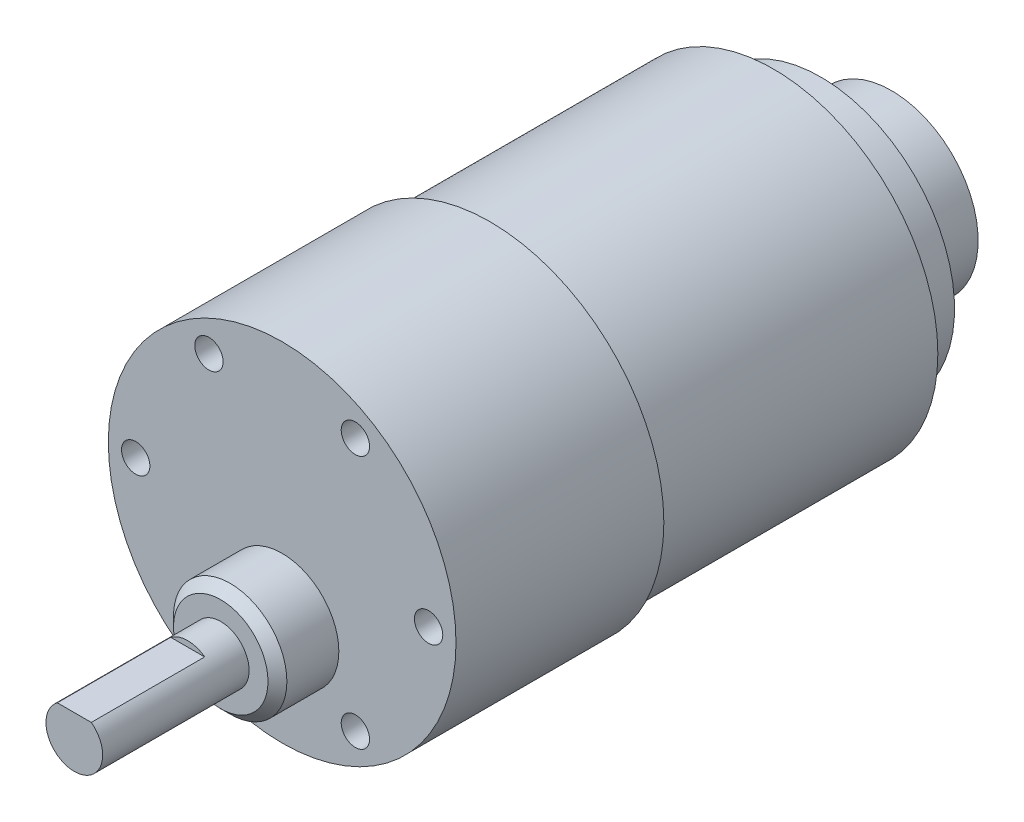
ISO-10303-21;
HEADER;
FILE_DESCRIPTION(('STEP AP214'),'2;1');
FILE_NAME('part.step','',(''),(''),'','','');
FILE_SCHEMA(('AUTOMOTIVE_DESIGN { 1 0 10303 214 1 1 1 1 }'));
ENDSEC;
DATA;
#1=APPLICATION_CONTEXT('core data for automotive mechanical design processes');
#2=APPLICATION_PROTOCOL_DEFINITION('international standard','automotive_design',2000,#1);
#3=PRODUCT_CONTEXT('',#1,'mechanical');
#4=PRODUCT('Part','Part','',(#3));
#5=PRODUCT_RELATED_PRODUCT_CATEGORY('part','',(#4));
#6=PRODUCT_DEFINITION_FORMATION('','',#4);
#7=PRODUCT_DEFINITION_CONTEXT('part definition',#1,'design');
#8=PRODUCT_DEFINITION('design','',#6,#7);
#9=PRODUCT_DEFINITION_SHAPE('','',#8);
#10=(LENGTH_UNIT() NAMED_UNIT(*) SI_UNIT(.MILLI.,.METRE.));
#11=(NAMED_UNIT(*) PLANE_ANGLE_UNIT() SI_UNIT($,.RADIAN.));
#12=(NAMED_UNIT(*) SI_UNIT($,.STERADIAN.) SOLID_ANGLE_UNIT());
#13=UNCERTAINTY_MEASURE_WITH_UNIT(LENGTH_MEASURE(1.E-05),#10,'distance_accuracy_value','');
#14=(GEOMETRIC_REPRESENTATION_CONTEXT(3) GLOBAL_UNCERTAINTY_ASSIGNED_CONTEXT((#13)) GLOBAL_UNIT_ASSIGNED_CONTEXT((#10,
#11,#12)) REPRESENTATION_CONTEXT('',''));
#15=CARTESIAN_POINT('',(0.,0.,0.));
#16=DIRECTION('',(0.,0.,1.));
#17=DIRECTION('',(1.,0.,0.));
#18=AXIS2_PLACEMENT_3D('',#15,#16,#17);
#19=CARTESIAN_POINT('',(0.,0.,-30.));
#20=DIRECTION('',(0.,0.,-1.));
#21=DIRECTION('',(-1.,0.,0.));
#22=AXIS2_PLACEMENT_3D('',#19,#20,#21);
#23=PLANE('',#22);
#24=CARTESIAN_POINT('',(0.,0.,-30.));
#25=DIRECTION('',(0.,0.,-1.));
#26=DIRECTION('',(-1.,0.,0.));
#27=AXIS2_PLACEMENT_3D('',#24,#25,#26);
#28=CIRCLE('',#27,17.4);
#29=CARTESIAN_POINT('',(-17.4,0.,-30.));
#30=VERTEX_POINT('',#29);
#31=EDGE_CURVE('E79',#30,#30,#28,.T.);
#32=ORIENTED_EDGE('',*,*,#31,.T.);
#33=EDGE_LOOP('',(#32));
#34=FACE_BOUND('',#33,.T.);
#35=CARTESIAN_POINT('',(0.,0.,-30.));
#36=DIRECTION('',(0.,0.,-1.));
#37=DIRECTION('',(-1.,0.,0.));
#38=AXIS2_PLACEMENT_3D('',#35,#36,#37);
#39=CIRCLE('',#38,14.1682647847948);
#40=CARTESIAN_POINT('',(-14.1682647847948,0.,-30.));
#41=VERTEX_POINT('',#40);
#42=EDGE_CURVE('E399',#41,#41,#39,.T.);
#43=ORIENTED_EDGE('',*,*,#42,.F.);
#44=EDGE_LOOP('',(#43));
#45=FACE_BOUND('',#44,.T.);
#46=ADVANCED_FACE('F36',(#34,#45),#23,.T.);
#47=CARTESIAN_POINT('',(0.,-7.,44.));
#48=DIRECTION('',(0.,0.,-1.));
#49=DIRECTION('',(-1.,0.,0.));
#50=AXIS2_PLACEMENT_3D('',#47,#48,#49);
#51=CYLINDRICAL_SURFACE('',#50,3.);
#52=CARTESIAN_POINT('',(0.,-7.,28.5));
#53=DIRECTION('',(0.,0.,1.));
#54=DIRECTION('',(1.,0.,0.));
#55=AXIS2_PLACEMENT_3D('',#52,#53,#54);
#56=CIRCLE('',#55,3.);
#57=CARTESIAN_POINT('',(3.,-7.,28.5));
#58=VERTEX_POINT('',#57);
#59=EDGE_CURVE('E73',#58,#58,#56,.T.);
#60=ORIENTED_EDGE('',*,*,#59,.T.);
#61=EDGE_LOOP('',(#60));
#62=FACE_BOUND('',#61,.T.);
#63=DIRECTION('',(0.,0.,-1.));
#64=VECTOR('',#63,1.);
#65=CARTESIAN_POINT('',(1.8,-4.6,44.));
#66=LINE('',#65,#64);
#67=CARTESIAN_POINT('',(1.8,-4.6,44.));
#68=VERTEX_POINT('',#67);
#69=CARTESIAN_POINT('',(1.8,-4.6,32.));
#70=VERTEX_POINT('',#69);
#71=EDGE_CURVE('E64',#68,#70,#66,.T.);
#72=ORIENTED_EDGE('',*,*,#71,.F.);
#73=CARTESIAN_POINT('',(0.,-7.,44.));
#74=DIRECTION('',(0.,0.,1.));
#75=DIRECTION('',(1.,0.,0.));
#76=AXIS2_PLACEMENT_3D('',#73,#74,#75);
#77=CIRCLE('',#76,3.);
#78=CARTESIAN_POINT('',(-1.8,-4.6,44.));
#79=VERTEX_POINT('',#78);
#80=EDGE_CURVE('E72',#79,#68,#77,.T.);
#81=ORIENTED_EDGE('',*,*,#80,.F.);
#82=DIRECTION('',(0.,0.,-1.));
#83=VECTOR('',#82,1.);
#84=CARTESIAN_POINT('',(-1.8,-4.6,44.));
#85=LINE('',#84,#83);
#86=CARTESIAN_POINT('',(-1.8,-4.6,32.));
#87=VERTEX_POINT('',#86);
#88=EDGE_CURVE('E52',#87,#79,#85,.F.);
#89=ORIENTED_EDGE('',*,*,#88,.F.);
#90=CARTESIAN_POINT('',(0.,-7.,32.));
#91=DIRECTION('',(0.,0.,1.));
#92=DIRECTION('',(1.,0.,0.));
#93=AXIS2_PLACEMENT_3D('',#90,#91,#92);
#94=CIRCLE('',#93,3.);
#95=EDGE_CURVE('E11',#70,#87,#94,.T.);
#96=ORIENTED_EDGE('',*,*,#95,.F.);
#97=EDGE_LOOP('',(#72,#81,#89,#96));
#98=FACE_BOUND('',#97,.T.);
#99=ADVANCED_FACE('F71',(#62,#98),#51,.T.);
#100=CARTESIAN_POINT('',(0.,-7.,44.));
#101=DIRECTION('',(0.,0.,1.));
#102=DIRECTION('',(1.,0.,0.));
#103=AXIS2_PLACEMENT_3D('',#100,#101,#102);
#104=PLANE('',#103);
#105=ORIENTED_EDGE('',*,*,#80,.T.);
#106=DIRECTION('',(-1.,0.,0.));
#107=VECTOR('',#106,1.);
#108=CARTESIAN_POINT('',(0.,-4.6,44.));
#109=LINE('',#108,#107);
#110=EDGE_CURVE('E45',#68,#79,#109,.T.);
#111=ORIENTED_EDGE('',*,*,#110,.T.);
#112=EDGE_LOOP('',(#105,#111));
#113=FACE_BOUND('',#112,.T.);
#114=ADVANCED_FACE('F75',(#113),#104,.T.);
#115=CARTESIAN_POINT('',(0.,-7.,28.5));
#116=DIRECTION('',(0.,0.,1.));
#117=DIRECTION('',(1.,0.,0.));
#118=AXIS2_PLACEMENT_3D('',#115,#116,#117);
#119=PLANE('',#118);
#120=CARTESIAN_POINT('',(0.,-7.,28.5));
#121=DIRECTION('',(0.,0.,1.));
#122=DIRECTION('',(1.,0.,0.));
#123=AXIS2_PLACEMENT_3D('',#120,#121,#122);
#124=CIRCLE('',#123,5.00000000000005);
#125=CARTESIAN_POINT('',(5.00000000000005,-7.,28.5));
#126=VERTEX_POINT('',#125);
#127=EDGE_CURVE('E96',#126,#126,#124,.T.);
#128=ORIENTED_EDGE('',*,*,#127,.T.);
#129=EDGE_LOOP('',(#128));
#130=FACE_BOUND('',#129,.T.);
#131=ORIENTED_EDGE('',*,*,#59,.F.);
#132=EDGE_LOOP('',(#131));
#133=FACE_BOUND('',#132,.T.);
#134=ADVANCED_FACE('F110',(#130,#133),#119,.T.);
#135=CARTESIAN_POINT('',(0.,0.,22.));
#136=DIRECTION('',(0.,0.,1.));
#137=DIRECTION('',(1.,0.,0.));
#138=AXIS2_PLACEMENT_3D('',#135,#136,#137);
#139=PLANE('',#138);
#140=CARTESIAN_POINT('',(7.75,-13.4233937586588,22.));
#141=DIRECTION('',(0.,0.,1.));
#142=DIRECTION('',(1.,0.,0.));
#143=AXIS2_PLACEMENT_3D('',#140,#141,#142);
#144=CIRCLE('',#143,1.5);
#145=CARTESIAN_POINT('',(9.25,-13.4233937586588,22.));
#146=VERTEX_POINT('',#145);
#147=EDGE_CURVE('E391',#146,#146,#144,.T.);
#148=ORIENTED_EDGE('',*,*,#147,.F.);
#149=EDGE_LOOP('',(#148));
#150=FACE_BOUND('',#149,.T.);
#151=CARTESIAN_POINT('',(-7.75,-13.4233937586588,22.));
#152=DIRECTION('',(0.,0.,1.));
#153=DIRECTION('',(1.,0.,0.));
#154=AXIS2_PLACEMENT_3D('',#151,#152,#153);
#155=CIRCLE('',#154,1.5);
#156=CARTESIAN_POINT('',(-6.25,-13.4233937586588,22.));
#157=VERTEX_POINT('',#156);
#158=EDGE_CURVE('E402',#157,#157,#155,.T.);
#159=ORIENTED_EDGE('',*,*,#158,.F.);
#160=EDGE_LOOP('',(#159));
#161=FACE_BOUND('',#160,.T.);
#162=CARTESIAN_POINT('',(-15.5,0.,22.));
#163=DIRECTION('',(0.,0.,1.));
#164=DIRECTION('',(1.,0.,0.));
#165=AXIS2_PLACEMENT_3D('',#162,#163,#164);
#166=CIRCLE('',#165,1.5);
#167=CARTESIAN_POINT('',(-14.,0.,22.));
#168=VERTEX_POINT('',#167);
#169=EDGE_CURVE('E407',#168,#168,#166,.T.);
#170=ORIENTED_EDGE('',*,*,#169,.F.);
#171=EDGE_LOOP('',(#170));
#172=FACE_BOUND('',#171,.T.);
#173=CARTESIAN_POINT('',(15.5,0.,22.));
#174=DIRECTION('',(0.,0.,1.));
#175=DIRECTION('',(1.,0.,0.));
#176=AXIS2_PLACEMENT_3D('',#173,#174,#175);
#177=CIRCLE('',#176,1.5);
#178=CARTESIAN_POINT('',(17.,0.,22.));
#179=VERTEX_POINT('',#178);
#180=EDGE_CURVE('E413',#179,#179,#177,.T.);
#181=ORIENTED_EDGE('',*,*,#180,.F.);
#182=EDGE_LOOP('',(#181));
#183=FACE_BOUND('',#182,.T.);
#184=CARTESIAN_POINT('',(7.75,13.4233937586588,22.));
#185=DIRECTION('',(0.,0.,1.));
#186=DIRECTION('',(1.,0.,0.));
#187=AXIS2_PLACEMENT_3D('',#184,#185,#186);
#188=CIRCLE('',#187,1.5);
#189=CARTESIAN_POINT('',(9.25,13.4233937586588,22.));
#190=VERTEX_POINT('',#189);
#191=EDGE_CURVE('E419',#190,#190,#188,.T.);
#192=ORIENTED_EDGE('',*,*,#191,.F.);
#193=EDGE_LOOP('',(#192));
#194=FACE_BOUND('',#193,.T.);
#195=CARTESIAN_POINT('',(-7.75,13.4233937586588,22.));
#196=DIRECTION('',(0.,0.,1.));
#197=DIRECTION('',(1.,0.,0.));
#198=AXIS2_PLACEMENT_3D('',#195,#196,#197);
#199=CIRCLE('',#198,1.5);
#200=CARTESIAN_POINT('',(-6.25,13.4233937586588,22.));
#201=VERTEX_POINT('',#200);
#202=EDGE_CURVE('E425',#201,#201,#199,.T.);
#203=ORIENTED_EDGE('',*,*,#202,.F.);
#204=EDGE_LOOP('',(#203));
#205=FACE_BOUND('',#204,.T.);
#206=CARTESIAN_POINT('',(0.,0.,22.));
#207=DIRECTION('',(0.,0.,1.));
#208=DIRECTION('',(1.,0.,0.));
#209=AXIS2_PLACEMENT_3D('',#206,#207,#208);
#210=CIRCLE('',#209,18.4);
#211=CARTESIAN_POINT('',(18.4,0.,22.));
#212=VERTEX_POINT('',#211);
#213=EDGE_CURVE('E88',#212,#212,#210,.T.);
#214=ORIENTED_EDGE('',*,*,#213,.T.);
#215=EDGE_LOOP('',(#214));
#216=FACE_BOUND('',#215,.T.);
#217=CARTESIAN_POINT('',(0.,-7.,22.));
#218=DIRECTION('',(0.,0.,1.));
#219=DIRECTION('',(1.,0.,0.));
#220=AXIS2_PLACEMENT_3D('',#217,#218,#219);
#221=CIRCLE('',#220,6.);
#222=CARTESIAN_POINT('',(6.,-7.,22.));
#223=VERTEX_POINT('',#222);
#224=EDGE_CURVE('E76',#223,#223,#221,.T.);
#225=ORIENTED_EDGE('',*,*,#224,.F.);
#226=EDGE_LOOP('',(#225));
#227=FACE_BOUND('',#226,.T.);
#228=ADVANCED_FACE('F113',(#150,#161,#172,#183,#194,#205,#216,#227),#139,.T.);
#229=CARTESIAN_POINT('',(0.,0.,0.));
#230=DIRECTION('',(0.,0.,1.));
#231=DIRECTION('',(1.,0.,0.));
#232=AXIS2_PLACEMENT_3D('',#229,#230,#231);
#233=PLANE('',#232);
#234=CARTESIAN_POINT('',(0.,0.,0.));
#235=DIRECTION('',(0.,0.,1.));
#236=DIRECTION('',(1.,0.,0.));
#237=AXIS2_PLACEMENT_3D('',#234,#235,#236);
#238=CIRCLE('',#237,18.4);
#239=CARTESIAN_POINT('',(18.4,0.,0.));
#240=VERTEX_POINT('',#239);
#241=EDGE_CURVE('E87',#240,#240,#238,.T.);
#242=ORIENTED_EDGE('',*,*,#241,.F.);
#243=EDGE_LOOP('',(#242));
#244=FACE_BOUND('',#243,.T.);
#245=CARTESIAN_POINT('',(0.,0.,0.));
#246=DIRECTION('',(0.,0.,1.));
#247=DIRECTION('',(1.,0.,0.));
#248=AXIS2_PLACEMENT_3D('',#245,#246,#247);
#249=CIRCLE('',#248,17.4);
#250=CARTESIAN_POINT('',(17.4,0.,0.));
#251=VERTEX_POINT('',#250);
#252=EDGE_CURVE('E91',#251,#251,#249,.F.);
#253=ORIENTED_EDGE('',*,*,#252,.F.);
#254=EDGE_LOOP('',(#253));
#255=FACE_BOUND('',#254,.T.);
#256=ADVANCED_FACE('F137',(#244,#255),#233,.F.);
#257=CARTESIAN_POINT('',(0.,0.,22.));
#258=DIRECTION('',(0.,0.,-1.));
#259=DIRECTION('',(-1.,0.,0.));
#260=AXIS2_PLACEMENT_3D('',#257,#258,#259);
#261=CYLINDRICAL_SURFACE('',#260,18.4);
#262=ORIENTED_EDGE('',*,*,#213,.F.);
#263=EDGE_LOOP('',(#262));
#264=FACE_BOUND('',#263,.T.);
#265=ORIENTED_EDGE('',*,*,#241,.T.);
#266=EDGE_LOOP('',(#265));
#267=FACE_BOUND('',#266,.T.);
#268=ADVANCED_FACE('F133',(#264,#267),#261,.T.);
#269=CARTESIAN_POINT('',(0.,0.,-30.));
#270=DIRECTION('',(0.,0.,1.));
#271=DIRECTION('',(1.,0.,0.));
#272=AXIS2_PLACEMENT_3D('',#269,#270,#271);
#273=CYLINDRICAL_SURFACE('',#272,17.4);
#274=ORIENTED_EDGE('',*,*,#31,.F.);
#275=EDGE_LOOP('',(#274));
#276=FACE_BOUND('',#275,.T.);
#277=ORIENTED_EDGE('',*,*,#252,.T.);
#278=EDGE_LOOP('',(#277));
#279=FACE_BOUND('',#278,.T.);
#280=ADVANCED_FACE('F129',(#276,#279),#273,.T.);
#281=CARTESIAN_POINT('',(0.,-7.,28.5));
#282=DIRECTION('',(0.,0.,-1.));
#283=DIRECTION('',(-1.,0.,0.));
#284=AXIS2_PLACEMENT_3D('',#281,#282,#283);
#285=CYLINDRICAL_SURFACE('',#284,6.);
#286=CARTESIAN_POINT('',(0.,-7.,27.5));
#287=DIRECTION('',(0.,0.,1.));
#288=DIRECTION('',(1.,0.,0.));
#289=AXIS2_PLACEMENT_3D('',#286,#287,#288);
#290=CIRCLE('',#289,6.);
#291=CARTESIAN_POINT('',(6.,-7.,27.5));
#292=VERTEX_POINT('',#291);
#293=EDGE_CURVE('E68',#292,#292,#290,.F.);
#294=ORIENTED_EDGE('',*,*,#293,.T.);
#295=EDGE_LOOP('',(#294));
#296=FACE_BOUND('',#295,.T.);
#297=ORIENTED_EDGE('',*,*,#224,.T.);
#298=EDGE_LOOP('',(#297));
#299=FACE_BOUND('',#298,.T.);
#300=ADVANCED_FACE('F102',(#296,#299),#285,.T.);
#301=CARTESIAN_POINT('',(0.,-7.,28.5));
#302=DIRECTION('',(0.,0.,-1.));
#303=DIRECTION('',(-1.,0.,0.));
#304=AXIS2_PLACEMENT_3D('',#301,#302,#303);
#305=CONICAL_SURFACE('',#304,5.00000000000005,0.785398163397445);
#306=ORIENTED_EDGE('',*,*,#293,.F.);
#307=EDGE_LOOP('',(#306));
#308=FACE_BOUND('',#307,.T.);
#309=ORIENTED_EDGE('',*,*,#127,.F.);
#310=EDGE_LOOP('',(#309));
#311=FACE_BOUND('',#310,.T.);
#312=ADVANCED_FACE('F38',(#308,#311),#305,.T.);
#313=CARTESIAN_POINT('',(15.5,-4.,32.));
#314=DIRECTION('',(0.,0.,1.));
#315=DIRECTION('',(1.,0.,0.));
#316=AXIS2_PLACEMENT_3D('',#313,#314,#315);
#317=PLANE('',#316);
#318=DIRECTION('',(-1.,0.,0.));
#319=VECTOR('',#318,1.);
#320=CARTESIAN_POINT('',(15.5,-4.6,32.));
#321=LINE('',#320,#319);
#322=EDGE_CURVE('E431',#70,#87,#321,.T.);
#323=ORIENTED_EDGE('',*,*,#322,.F.);
#324=ORIENTED_EDGE('',*,*,#95,.T.);
#325=EDGE_LOOP('',(#323,#324));
#326=FACE_BOUND('',#325,.T.);
#327=ADVANCED_FACE('F107',(#326),#317,.T.);
#328=CARTESIAN_POINT('',(15.5,-4.6,44.));
#329=DIRECTION('',(0.,1.,0.));
#330=DIRECTION('',(0.,0.,1.));
#331=AXIS2_PLACEMENT_3D('',#328,#329,#330);
#332=PLANE('',#331);
#333=ORIENTED_EDGE('',*,*,#71,.T.);
#334=ORIENTED_EDGE('',*,*,#322,.T.);
#335=ORIENTED_EDGE('',*,*,#88,.T.);
#336=ORIENTED_EDGE('',*,*,#110,.F.);
#337=EDGE_LOOP('',(#333,#334,#335,#336));
#338=FACE_BOUND('',#337,.T.);
#339=ADVANCED_FACE('F63',(#338),#332,.T.);
#340=CARTESIAN_POINT('',(-7.75,13.4233937586588,17.));
#341=DIRECTION('',(0.,0.,1.));
#342=DIRECTION('',(1.,0.,0.));
#343=AXIS2_PLACEMENT_3D('',#340,#341,#342);
#344=CYLINDRICAL_SURFACE('',#343,1.5);
#345=CARTESIAN_POINT('',(-7.75,13.4233937586588,17.));
#346=DIRECTION('',(0.,0.,1.));
#347=DIRECTION('',(1.,0.,0.));
#348=AXIS2_PLACEMENT_3D('',#345,#346,#347);
#349=CIRCLE('',#348,1.5);
#350=CARTESIAN_POINT('',(-6.25,13.4233937586588,17.));
#351=VERTEX_POINT('',#350);
#352=EDGE_CURVE('E428',#351,#351,#349,.T.);
#353=ORIENTED_EDGE('',*,*,#352,.F.);
#354=EDGE_LOOP('',(#353));
#355=FACE_BOUND('',#354,.T.);
#356=ORIENTED_EDGE('',*,*,#202,.T.);
#357=EDGE_LOOP('',(#356));
#358=FACE_BOUND('',#357,.T.);
#359=ADVANCED_FACE('F182',(#355,#358),#344,.F.);
#360=CARTESIAN_POINT('',(-7.75,13.4233937586588,17.));
#361=DIRECTION('',(0.,0.,1.));
#362=DIRECTION('',(1.,0.,0.));
#363=AXIS2_PLACEMENT_3D('',#360,#361,#362);
#364=PLANE('',#363);
#365=ORIENTED_EDGE('',*,*,#352,.T.);
#366=EDGE_LOOP('',(#365));
#367=FACE_BOUND('',#366,.T.);
#368=ADVANCED_FACE('F189',(#367),#364,.T.);
#369=CARTESIAN_POINT('',(7.75,13.4233937586588,17.));
#370=DIRECTION('',(0.,0.,1.));
#371=DIRECTION('',(1.,0.,0.));
#372=AXIS2_PLACEMENT_3D('',#369,#370,#371);
#373=CYLINDRICAL_SURFACE('',#372,1.5);
#374=CARTESIAN_POINT('',(7.75,13.4233937586588,17.));
#375=DIRECTION('',(0.,0.,1.));
#376=DIRECTION('',(1.,0.,0.));
#377=AXIS2_PLACEMENT_3D('',#374,#375,#376);
#378=CIRCLE('',#377,1.5);
#379=CARTESIAN_POINT('',(9.25,13.4233937586588,17.));
#380=VERTEX_POINT('',#379);
#381=EDGE_CURVE('E422',#380,#380,#378,.T.);
#382=ORIENTED_EDGE('',*,*,#381,.F.);
#383=EDGE_LOOP('',(#382));
#384=FACE_BOUND('',#383,.T.);
#385=ORIENTED_EDGE('',*,*,#191,.T.);
#386=EDGE_LOOP('',(#385));
#387=FACE_BOUND('',#386,.T.);
#388=ADVANCED_FACE('F197',(#384,#387),#373,.F.);
#389=CARTESIAN_POINT('',(7.75,13.4233937586588,17.));
#390=DIRECTION('',(0.,0.,1.));
#391=DIRECTION('',(1.,0.,0.));
#392=AXIS2_PLACEMENT_3D('',#389,#390,#391);
#393=PLANE('',#392);
#394=ORIENTED_EDGE('',*,*,#381,.T.);
#395=EDGE_LOOP('',(#394));
#396=FACE_BOUND('',#395,.T.);
#397=ADVANCED_FACE('F205',(#396),#393,.T.);
#398=CARTESIAN_POINT('',(15.5,0.,17.));
#399=DIRECTION('',(0.,0.,1.));
#400=DIRECTION('',(1.,0.,0.));
#401=AXIS2_PLACEMENT_3D('',#398,#399,#400);
#402=CYLINDRICAL_SURFACE('',#401,1.5);
#403=CARTESIAN_POINT('',(15.5,0.,17.));
#404=DIRECTION('',(0.,0.,1.));
#405=DIRECTION('',(1.,0.,0.));
#406=AXIS2_PLACEMENT_3D('',#403,#404,#405);
#407=CIRCLE('',#406,1.5);
#408=CARTESIAN_POINT('',(17.,0.,17.));
#409=VERTEX_POINT('',#408);
#410=EDGE_CURVE('E416',#409,#409,#407,.T.);
#411=ORIENTED_EDGE('',*,*,#410,.F.);
#412=EDGE_LOOP('',(#411));
#413=FACE_BOUND('',#412,.T.);
#414=ORIENTED_EDGE('',*,*,#180,.T.);
#415=EDGE_LOOP('',(#414));
#416=FACE_BOUND('',#415,.T.);
#417=ADVANCED_FACE('F213',(#413,#416),#402,.F.);
#418=CARTESIAN_POINT('',(15.5,0.,17.));
#419=DIRECTION('',(0.,0.,1.));
#420=DIRECTION('',(1.,0.,0.));
#421=AXIS2_PLACEMENT_3D('',#418,#419,#420);
#422=PLANE('',#421);
#423=ORIENTED_EDGE('',*,*,#410,.T.);
#424=EDGE_LOOP('',(#423));
#425=FACE_BOUND('',#424,.T.);
#426=ADVANCED_FACE('F221',(#425),#422,.T.);
#427=CARTESIAN_POINT('',(-15.5,0.,17.));
#428=DIRECTION('',(0.,0.,1.));
#429=DIRECTION('',(1.,0.,0.));
#430=AXIS2_PLACEMENT_3D('',#427,#428,#429);
#431=CYLINDRICAL_SURFACE('',#430,1.5);
#432=CARTESIAN_POINT('',(-15.5,0.,17.));
#433=DIRECTION('',(0.,0.,1.));
#434=DIRECTION('',(1.,0.,0.));
#435=AXIS2_PLACEMENT_3D('',#432,#433,#434);
#436=CIRCLE('',#435,1.5);
#437=CARTESIAN_POINT('',(-14.,0.,17.));
#438=VERTEX_POINT('',#437);
#439=EDGE_CURVE('E410',#438,#438,#436,.T.);
#440=ORIENTED_EDGE('',*,*,#439,.F.);
#441=EDGE_LOOP('',(#440));
#442=FACE_BOUND('',#441,.T.);
#443=ORIENTED_EDGE('',*,*,#169,.T.);
#444=EDGE_LOOP('',(#443));
#445=FACE_BOUND('',#444,.T.);
#446=ADVANCED_FACE('F229',(#442,#445),#431,.F.);
#447=CARTESIAN_POINT('',(-15.5,0.,17.));
#448=DIRECTION('',(0.,0.,1.));
#449=DIRECTION('',(1.,0.,0.));
#450=AXIS2_PLACEMENT_3D('',#447,#448,#449);
#451=PLANE('',#450);
#452=ORIENTED_EDGE('',*,*,#439,.T.);
#453=EDGE_LOOP('',(#452));
#454=FACE_BOUND('',#453,.T.);
#455=ADVANCED_FACE('F237',(#454),#451,.T.);
#456=CARTESIAN_POINT('',(-7.75,-13.4233937586588,17.));
#457=DIRECTION('',(0.,0.,1.));
#458=DIRECTION('',(1.,0.,0.));
#459=AXIS2_PLACEMENT_3D('',#456,#457,#458);
#460=CYLINDRICAL_SURFACE('',#459,1.5);
#461=CARTESIAN_POINT('',(-7.75,-13.4233937586588,17.));
#462=DIRECTION('',(0.,0.,1.));
#463=DIRECTION('',(1.,0.,0.));
#464=AXIS2_PLACEMENT_3D('',#461,#462,#463);
#465=CIRCLE('',#464,1.5);
#466=CARTESIAN_POINT('',(-6.25,-13.4233937586588,17.));
#467=VERTEX_POINT('',#466);
#468=EDGE_CURVE('E404',#467,#467,#465,.T.);
#469=ORIENTED_EDGE('',*,*,#468,.F.);
#470=EDGE_LOOP('',(#469));
#471=FACE_BOUND('',#470,.T.);
#472=ORIENTED_EDGE('',*,*,#158,.T.);
#473=EDGE_LOOP('',(#472));
#474=FACE_BOUND('',#473,.T.);
#475=ADVANCED_FACE('F245',(#471,#474),#460,.F.);
#476=CARTESIAN_POINT('',(-7.75,-13.4233937586588,17.));
#477=DIRECTION('',(0.,0.,1.));
#478=DIRECTION('',(1.,0.,0.));
#479=AXIS2_PLACEMENT_3D('',#476,#477,#478);
#480=PLANE('',#479);
#481=ORIENTED_EDGE('',*,*,#468,.T.);
#482=EDGE_LOOP('',(#481));
#483=FACE_BOUND('',#482,.T.);
#484=ADVANCED_FACE('F253',(#483),#480,.T.);
#485=CARTESIAN_POINT('',(7.75,-13.4233937586588,17.));
#486=DIRECTION('',(0.,0.,1.));
#487=DIRECTION('',(1.,0.,0.));
#488=AXIS2_PLACEMENT_3D('',#485,#486,#487);
#489=CYLINDRICAL_SURFACE('',#488,1.5);
#490=CARTESIAN_POINT('',(7.75,-13.4233937586588,17.));
#491=DIRECTION('',(0.,0.,1.));
#492=DIRECTION('',(1.,0.,0.));
#493=AXIS2_PLACEMENT_3D('',#490,#491,#492);
#494=CIRCLE('',#493,1.5);
#495=CARTESIAN_POINT('',(9.25,-13.4233937586588,17.));
#496=VERTEX_POINT('',#495);
#497=EDGE_CURVE('E394',#496,#496,#494,.T.);
#498=ORIENTED_EDGE('',*,*,#497,.F.);
#499=EDGE_LOOP('',(#498));
#500=FACE_BOUND('',#499,.T.);
#501=ORIENTED_EDGE('',*,*,#147,.T.);
#502=EDGE_LOOP('',(#501));
#503=FACE_BOUND('',#502,.T.);
#504=ADVANCED_FACE('F261',(#500,#503),#489,.F.);
#505=CARTESIAN_POINT('',(7.75,-13.4233937586588,17.));
#506=DIRECTION('',(0.,0.,1.));
#507=DIRECTION('',(1.,0.,0.));
#508=AXIS2_PLACEMENT_3D('',#505,#506,#507);
#509=PLANE('',#508);
#510=ORIENTED_EDGE('',*,*,#497,.T.);
#511=EDGE_LOOP('',(#510));
#512=FACE_BOUND('',#511,.T.);
#513=ADVANCED_FACE('F269',(#512),#509,.T.);
#514=CARTESIAN_POINT('',(0.,0.,-35.));
#515=DIRECTION('',(0.,0.,-1.));
#516=DIRECTION('',(-1.,0.,0.));
#517=AXIS2_PLACEMENT_3D('',#514,#515,#516);
#518=PLANE('',#517);
#519=CARTESIAN_POINT('',(0.,0.,-35.));
#520=DIRECTION('',(0.,0.,-1.));
#521=DIRECTION('',(-1.,0.,0.));
#522=AXIS2_PLACEMENT_3D('',#519,#520,#521);
#523=CIRCLE('',#522,14.1682647847948);
#524=CARTESIAN_POINT('',(-14.1682647847948,0.,-35.));
#525=VERTEX_POINT('',#524);
#526=EDGE_CURVE('E396',#525,#525,#523,.T.);
#527=ORIENTED_EDGE('',*,*,#526,.T.);
#528=EDGE_LOOP('',(#527));
#529=FACE_BOUND('',#528,.T.);
#530=CARTESIAN_POINT('',(0.,0.,-35.));
#531=DIRECTION('',(0.,0.,-1.));
#532=DIRECTION('',(-1.,0.,0.));
#533=AXIS2_PLACEMENT_3D('',#530,#531,#532);
#534=CIRCLE('',#533,9.16826478479481);
#535=CARTESIAN_POINT('',(-9.16826478479481,0.,-35.));
#536=VERTEX_POINT('',#535);
#537=EDGE_CURVE('E40',#536,#536,#534,.T.);
#538=ORIENTED_EDGE('',*,*,#537,.F.);
#539=EDGE_LOOP('',(#538));
#540=FACE_BOUND('',#539,.T.);
#541=ADVANCED_FACE('F277',(#529,#540),#518,.T.);
#542=CARTESIAN_POINT('',(0.,0.,-35.));
#543=DIRECTION('',(0.,0.,1.));
#544=DIRECTION('',(1.,0.,0.));
#545=AXIS2_PLACEMENT_3D('',#542,#543,#544);
#546=CYLINDRICAL_SURFACE('',#545,14.1682647847948);
#547=ORIENTED_EDGE('',*,*,#526,.F.);
#548=EDGE_LOOP('',(#547));
#549=FACE_BOUND('',#548,.T.);
#550=ORIENTED_EDGE('',*,*,#42,.T.);
#551=EDGE_LOOP('',(#550));
#552=FACE_BOUND('',#551,.T.);
#553=ADVANCED_FACE('F286',(#549,#552),#546,.T.);
#554=CARTESIAN_POINT('',(0.,0.,-42.5));
#555=DIRECTION('',(0.,0.,-1.));
#556=DIRECTION('',(-1.,0.,0.));
#557=AXIS2_PLACEMENT_3D('',#554,#555,#556);
#558=PLANE('',#557);
#559=CARTESIAN_POINT('',(0.,0.,-42.5));
#560=DIRECTION('',(0.,0.,-1.));
#561=DIRECTION('',(-1.,0.,0.));
#562=AXIS2_PLACEMENT_3D('',#559,#560,#561);
#563=CIRCLE('',#562,9.16826478479481);
#564=CARTESIAN_POINT('',(-9.16826478479481,0.,-42.5));
#565=VERTEX_POINT('',#564);
#566=EDGE_CURVE('E390',#565,#565,#563,.T.);
#567=ORIENTED_EDGE('',*,*,#566,.T.);
#568=EDGE_LOOP('',(#567));
#569=FACE_BOUND('',#568,.T.);
#570=ADVANCED_FACE('F295',(#569),#558,.T.);
#571=CARTESIAN_POINT('',(0.,0.,-42.5));
#572=DIRECTION('',(0.,0.,1.));
#573=DIRECTION('',(1.,0.,0.));
#574=AXIS2_PLACEMENT_3D('',#571,#572,#573);
#575=CYLINDRICAL_SURFACE('',#574,9.16826478479481);
#576=ORIENTED_EDGE('',*,*,#537,.T.);
#577=EDGE_LOOP('',(#576));
#578=FACE_BOUND('',#577,.T.);
#579=ORIENTED_EDGE('',*,*,#566,.F.);
#580=EDGE_LOOP('',(#579));
#581=FACE_BOUND('',#580,.T.);
#582=ADVANCED_FACE('F303',(#578,#581),#575,.T.);
#583=CLOSED_SHELL('',(#46,#99,#114,#134,#228,#256,#268,#280,#300,#312,#327,#339,#359,#368,#388,
#397,#417,#426,#446,#455,#475,#484,#504,#513,#541,#553,#570,#582));
#584=MANIFOLD_SOLID_BREP('B2',#583);
#585=ADVANCED_BREP_SHAPE_REPRESENTATION('',(#18,#584),#14);
#586=SHAPE_DEFINITION_REPRESENTATION(#9,#585);
ENDSEC;
END-ISO-10303-21;
